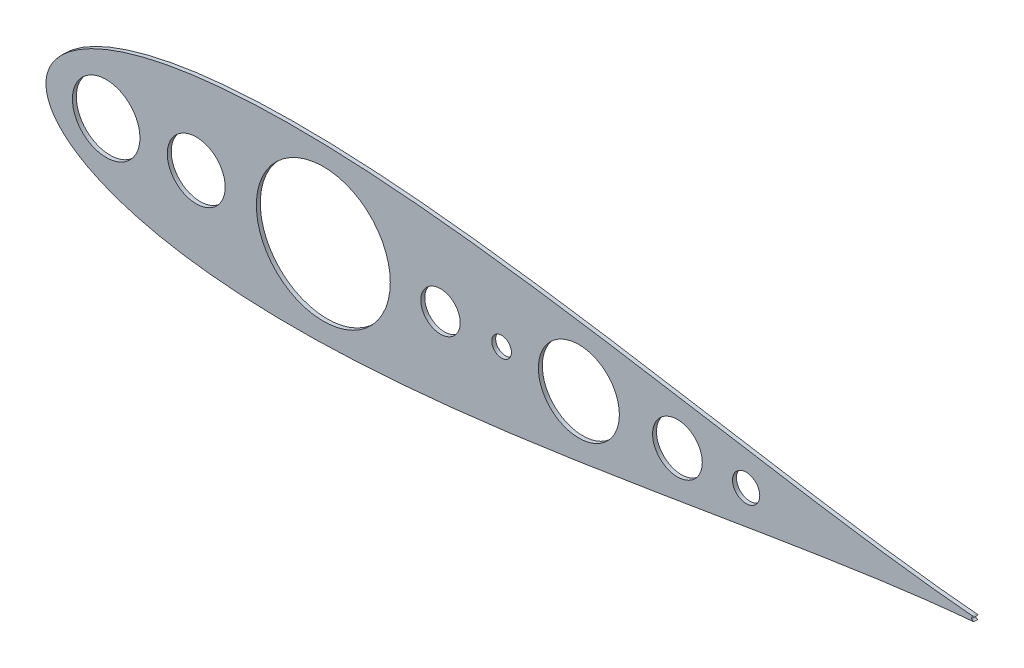
ISO-10303-21;
HEADER;
FILE_DESCRIPTION(('STEP AP214'),'2;1');
FILE_NAME('part.step','',(''),(''),'','','');
FILE_SCHEMA(('AUTOMOTIVE_DESIGN { 1 0 10303 214 1 1 1 1 }'));
ENDSEC;
DATA;
#1=APPLICATION_CONTEXT('core data for automotive mechanical design processes');
#2=APPLICATION_PROTOCOL_DEFINITION('international standard','automotive_design',2000,#1);
#3=PRODUCT_CONTEXT('',#1,'mechanical');
#4=PRODUCT('Part','Part','',(#3));
#5=PRODUCT_RELATED_PRODUCT_CATEGORY('part','',(#4));
#6=PRODUCT_DEFINITION_FORMATION('','',#4);
#7=PRODUCT_DEFINITION_CONTEXT('part definition',#1,'design');
#8=PRODUCT_DEFINITION('design','',#6,#7);
#9=PRODUCT_DEFINITION_SHAPE('','',#8);
#10=(LENGTH_UNIT() NAMED_UNIT(*) SI_UNIT(.MILLI.,.METRE.));
#11=(NAMED_UNIT(*) PLANE_ANGLE_UNIT() SI_UNIT($,.RADIAN.));
#12=(NAMED_UNIT(*) SI_UNIT($,.STERADIAN.) SOLID_ANGLE_UNIT());
#13=UNCERTAINTY_MEASURE_WITH_UNIT(LENGTH_MEASURE(1.E-05),#10,'distance_accuracy_value','');
#14=(GEOMETRIC_REPRESENTATION_CONTEXT(3) GLOBAL_UNCERTAINTY_ASSIGNED_CONTEXT((#13)) GLOBAL_UNIT_ASSIGNED_CONTEXT((#10,
#11,#12)) REPRESENTATION_CONTEXT('',''));
#15=CARTESIAN_POINT('',(0.,0.,0.));
#16=DIRECTION('',(0.,0.,1.));
#17=DIRECTION('',(1.,0.,0.));
#18=AXIS2_PLACEMENT_3D('',#15,#16,#17);
#19=CARTESIAN_POINT('',(293.281074332886,511.948665512578,2.54));
#20=DIRECTION('',(0.,0.,1.));
#21=DIRECTION('',(1.,0.,0.));
#22=AXIS2_PLACEMENT_3D('',#19,#20,#21);
#23=PLANE('',#22);
#24=CARTESIAN_POINT('',(636.78788281488,511.9486655088,2.54));
#25=DIRECTION('',(0.,0.,1.));
#26=DIRECTION('',(1.,0.,0.));
#27=AXIS2_PLACEMENT_3D('',#24,#25,#26);
#28=CIRCLE('',#27,26.103165950104);
#29=CARTESIAN_POINT('',(662.891048764984,511.9486655088,2.54));
#30=VERTEX_POINT('',#29);
#31=EDGE_CURVE('E156',#30,#30,#28,.T.);
#32=ORIENTED_EDGE('',*,*,#31,.F.);
#33=EDGE_LOOP('',(#32));
#34=FACE_BOUND('',#33,.T.);
#35=CARTESIAN_POINT('',(744.61753790952,511.9486655088,2.54));
#36=DIRECTION('',(0.,0.,1.));
#37=DIRECTION('',(1.,0.,0.));
#38=AXIS2_PLACEMENT_3D('',#35,#36,#37);
#39=CIRCLE('',#38,8.77991454979843);
#40=CARTESIAN_POINT('',(753.397452459318,511.9486655088,2.54));
#41=VERTEX_POINT('',#40);
#42=EDGE_CURVE('E144',#41,#41,#39,.T.);
#43=ORIENTED_EDGE('',*,*,#42,.F.);
#44=EDGE_LOOP('',(#43));
#45=FACE_BOUND('',#44,.T.);
#46=CARTESIAN_POINT('',(586.98127433584,511.9486655088,2.54));
#47=DIRECTION('',(0.,0.,1.));
#48=DIRECTION('',(1.,0.,0.));
#49=AXIS2_PLACEMENT_3D('',#46,#47,#48);
#50=CIRCLE('',#49,6.34999999999997);
#51=CARTESIAN_POINT('',(593.33127433584,511.9486655088,2.54));
#52=VERTEX_POINT('',#51);
#53=EDGE_CURVE('E132',#52,#52,#50,.T.);
#54=ORIENTED_EDGE('',*,*,#53,.F.);
#55=EDGE_LOOP('',(#54));
#56=FACE_BOUND('',#55,.T.);
#57=CARTESIAN_POINT('',(390.13127433584,511.9486655088,2.54));
#58=DIRECTION('',(0.,0.,1.));
#59=DIRECTION('',(1.,0.,0.));
#60=AXIS2_PLACEMENT_3D('',#57,#58,#59);
#61=CIRCLE('',#60,18.6689999999999);
#62=CARTESIAN_POINT('',(408.80027433584,511.9486655088,2.54));
#63=VERTEX_POINT('',#62);
#64=EDGE_CURVE('E102',#63,#63,#61,.T.);
#65=ORIENTED_EDGE('',*,*,#64,.F.);
#66=EDGE_LOOP('',(#65));
#67=FACE_BOUND('',#66,.T.);
#68=CARTESIAN_POINT('',(890.816164168567,513.419961884589,2.54));
#69=CARTESIAN_POINT('',(890.334929222572,513.459981199005,2.54));
#70=CARTESIAN_POINT('',(886.708241771452,513.765463671506,2.54));
#71=CARTESIAN_POINT('',(879.565924572486,514.425614021273,2.54));
#72=CARTESIAN_POINT('',(868.964209832471,515.528471420177,2.54));
#73=CARTESIAN_POINT('',(857.2098136494,516.881784467169,2.54));
#74=CARTESIAN_POINT('',(844.346922272968,518.493665976181,2.54));
#75=CARTESIAN_POINT('',(830.43554664155,520.365757129327,2.54));
#76=CARTESIAN_POINT('',(815.53584611597,522.493860763745,2.54));
#77=CARTESIAN_POINT('',(799.712341782464,524.866984311248,2.54));
#78=CARTESIAN_POINT('',(783.032227934467,527.468245812839,2.54));
#79=CARTESIAN_POINT('',(765.565384489673,530.274419359116,2.54));
#80=CARTESIAN_POINT('',(747.383994901154,533.25652103142,2.54));
#81=CARTESIAN_POINT('',(728.562336326036,536.380171048516,2.54));
#82=CARTESIAN_POINT('',(709.176538958193,539.605942424294,2.54));
#83=CARTESIAN_POINT('',(689.30445845677,542.890066944774,2.54));
#84=CARTESIAN_POINT('',(669.025547896793,546.184960619501,2.54));
#85=CARTESIAN_POINT('',(648.42079078857,549.440003689073,2.54));
#86=CARTESIAN_POINT('',(627.572657185412,552.602222867619,2.54));
#87=CARTESIAN_POINT('',(606.565100392426,555.617231647367,2.54));
#88=CARTESIAN_POINT('',(585.483547135847,558.429920335062,2.54));
#89=CARTESIAN_POINT('',(564.414918297596,560.985438327197,2.54));
#90=CARTESIAN_POINT('',(543.447643351904,563.229982453391,2.54));
#91=CARTESIAN_POINT('',(522.671673877383,565.111747073367,2.54));
#92=CARTESIAN_POINT('',(502.178474967283,566.581679788875,2.54));
#93=CARTESIAN_POINT('',(482.061023450331,567.594398693799,2.54));
#94=CARTESIAN_POINT('',(462.413787665805,568.10904622475,2.54));
#95=CARTESIAN_POINT('',(443.332695327594,568.089939544025,2.54));
#96=CARTESIAN_POINT('',(424.9151657929,567.506768629212,2.54));
#97=CARTESIAN_POINT('',(407.260111585684,566.336700549149,2.54));
#98=CARTESIAN_POINT('',(390.468225820178,564.562768169564,2.54));
#99=CARTESIAN_POINT('',(374.64214166451,562.176975247802,2.54));
#100=CARTESIAN_POINT('',(359.887391690253,559.178484875364,2.54));
#101=CARTESIAN_POINT('',(346.313124376857,555.577330563573,2.54));
#102=CARTESIAN_POINT('',(334.034096859812,551.394617800472,2.54));
#103=CARTESIAN_POINT('',(323.172804405046,546.667615259219,2.54));
#104=CARTESIAN_POINT('',(313.861144191933,541.458918977684,2.54));
#105=CARTESIAN_POINT('',(306.238228210125,535.874228771115,2.54));
#106=CARTESIAN_POINT('',(300.432417667747,530.095948610258,2.54));
#107=CARTESIAN_POINT('',(296.501791131961,524.429595123793,2.54));
#108=CARTESIAN_POINT('',(294.309964234523,519.31741768687,2.54));
#109=CARTESIAN_POINT('',(293.424863103749,515.216496364596,2.54));
#110=CARTESIAN_POINT('',(293.223273347112,511.948665512578,2.54));
#111=CARTESIAN_POINT('',(293.424863103749,508.68083466056,2.54));
#112=CARTESIAN_POINT('',(294.309964234523,504.579913338286,2.54));
#113=CARTESIAN_POINT('',(296.501791131961,499.467735901363,2.54));
#114=CARTESIAN_POINT('',(300.432417667747,493.801382414899,2.54));
#115=CARTESIAN_POINT('',(306.238228210125,488.023102254041,2.54));
#116=CARTESIAN_POINT('',(313.861144191933,482.438412047471,2.54));
#117=CARTESIAN_POINT('',(323.172804405046,477.229715765937,2.54));
#118=CARTESIAN_POINT('',(334.034096859812,472.502713224683,2.54));
#119=CARTESIAN_POINT('',(346.313124376857,468.320000461583,2.54));
#120=CARTESIAN_POINT('',(359.887391690253,464.718846149792,2.54));
#121=CARTESIAN_POINT('',(374.64214166451,461.720355777354,2.54));
#122=CARTESIAN_POINT('',(390.468225820178,459.334562855592,2.54));
#123=CARTESIAN_POINT('',(407.260111585684,457.560630476007,2.54));
#124=CARTESIAN_POINT('',(424.9151657929,456.390562395944,2.54));
#125=CARTESIAN_POINT('',(443.332695327594,455.80739148113,2.54));
#126=CARTESIAN_POINT('',(462.413787665805,455.788284800406,2.54));
#127=CARTESIAN_POINT('',(482.061023450331,456.302932331357,2.54));
#128=CARTESIAN_POINT('',(502.178474967283,457.315651236281,2.54));
#129=CARTESIAN_POINT('',(522.671673877383,458.785583951789,2.54));
#130=CARTESIAN_POINT('',(543.447643351904,460.667348571765,2.54));
#131=CARTESIAN_POINT('',(564.414918297596,462.911892697959,2.54));
#132=CARTESIAN_POINT('',(585.483547135847,465.467410690093,2.54));
#133=CARTESIAN_POINT('',(606.565100392426,468.280099377789,2.54));
#134=CARTESIAN_POINT('',(627.572657185412,471.295108157537,2.54));
#135=CARTESIAN_POINT('',(648.42079078857,474.457327336083,2.54));
#136=CARTESIAN_POINT('',(669.025547896793,477.712370405654,2.54));
#137=CARTESIAN_POINT('',(689.30445845677,481.007264080382,2.54));
#138=CARTESIAN_POINT('',(709.176538958193,484.291388600862,2.54));
#139=CARTESIAN_POINT('',(728.562336326036,487.51715997664,2.54));
#140=CARTESIAN_POINT('',(747.383994901154,490.640809993736,2.54));
#141=CARTESIAN_POINT('',(765.565384489673,493.62291166604,2.54));
#142=CARTESIAN_POINT('',(783.032227934467,496.429085212317,2.54));
#143=CARTESIAN_POINT('',(799.712341782464,499.030346713908,2.54));
#144=CARTESIAN_POINT('',(815.53584611597,501.403470261411,2.54));
#145=CARTESIAN_POINT('',(830.43554664155,503.531573895829,2.54));
#146=CARTESIAN_POINT('',(844.346922272967,505.403665048974,2.54));
#147=CARTESIAN_POINT('',(857.2098136494,507.015546557987,2.54));
#148=CARTESIAN_POINT('',(868.96420983247,508.368859604979,2.54));
#149=CARTESIAN_POINT('',(879.565924572486,509.471717003883,2.54));
#150=CARTESIAN_POINT('',(886.708241771452,510.13186735365,2.54));
#151=CARTESIAN_POINT('',(890.334929222572,510.437349826151,2.54));
#152=CARTESIAN_POINT('',(890.816164168567,510.477369135637,2.54));
#153=B_SPLINE_CURVE_WITH_KNOTS('',3,(#68,#69,#70,#71,#72,#73,#74,#75,#76,#77,#78,#79,#80,#81,
#82,#83,#84,#85,#86,#87,#88,#89,#90,#91,#92,#93,#94,#95,#96,#97,#98,#99,#100,#101,#102,#103,
#104,#105,#106,#107,#108,#109,#110,#111,#112,#113,#114,#115,#116,#117,#118,#119,#120,#121,#122,
#123,#124,#125,#126,#127,#128,#129,#130,#131,#132,#133,#134,#135,#136,#137,#138,#139,#140,#141,
#142,#143,#144,#145,#146,#147,#148,#149,#150,#151,#152),.UNSPECIFIED.,.F.,.F.,(4,1,1,1,1,1,1,1,
1,1,1,1,1,1,1,1,1,1,1,1,1,1,1,1,1,1,1,1,1,1,1,1,1,1,1,1,1,1,1,1,1,1,1,1,1,1,1,1,1,1,1,1,1,1,1,1,
1,1,1,1,1,1,1,1,1,1,1,1,1,1,1,1,1,1,1,1,1,1,1,1,1,1,4),(0.020157042076269,0.0212708876900959,
0.0285525550130683,0.0367806836725549,0.0459201019032637,0.0559317636633187,0.0667728836144854,
0.0783971303496518,0.0907548266908363,0.103793164577546,0.117456431914319,0.131686225652521,
0.146421738497113,0.161599998000845,0.177156132626574,0.193023668070302,0.209134785631037,
0.225420632511523,0.241811601924249,0.258237646860869,0.274628556698349,0.290914287398014,
0.307025228908797,0.322892517177238,0.33844834182358,0.353626206573582,0.368361231970712,
0.382590427827798,0.396252960572084,0.40929041186716,0.421647009590257,0.433269881487031,
0.444109248914041,0.454118639688981,0.463255054987312,0.471479113777303,0.478755288570903,
0.485052318112802,0.490344025694165,0.494609832614287,0.497833231437255,0.5,0.502166768562745,
0.505390167385713,0.509655974305835,0.514947681887198,0.521244711429097,0.528520886222697,
0.536744945012688,0.545881360311019,0.555890751085959,0.566730118512969,0.578352990409744,
0.59070958813284,0.603747039427916,0.617409572172202,0.631638768029288,0.646373793426418,
0.66155165817642,0.677107482822761,0.692974771091203,0.709085712601986,0.725371443301651,
0.741762353139131,0.758188398075751,0.774579367488477,0.790865214368963,0.806976331929698,
0.822843867373426,0.838400001999155,0.853578261502887,0.868313774347479,0.882543568085681,
0.896206835422454,0.909245173309164,0.921602869650348,0.933227116385514,0.944068236336681,
0.954079898096736,0.963219316327445,0.971447444986932,0.978729112309904,0.979842957923731),.UNSPECIFIED.);
#154=CARTESIAN_POINT('',(890.816164168567,513.419961884589,2.54));
#155=VERTEX_POINT('',#154);
#156=CARTESIAN_POINT('',(890.816164168567,510.477369135637,2.54));
#157=VERTEX_POINT('',#156);
#158=EDGE_CURVE('E86',#155,#157,#153,.T.);
#159=ORIENTED_EDGE('',*,*,#158,.T.);
#160=CARTESIAN_POINT('',(890.693811728639,511.948665508647,2.54));
#161=DIRECTION('',(0.,0.,1.));
#162=DIRECTION('',(1.,0.,0.));
#163=AXIS2_PLACEMENT_3D('',#160,#161,#162);
#164=CIRCLE('',#163,1.47637499870053);
#165=CARTESIAN_POINT('',(891.548394929515,510.74476738606,2.54));
#166=VERTEX_POINT('',#165);
#167=EDGE_CURVE('E81',#157,#166,#164,.T.);
#168=ORIENTED_EDGE('',*,*,#167,.T.);
#169=CARTESIAN_POINT('',(891.232241768944,511.948543253512,2.54));
#170=DIRECTION('',(0.,0.,-1.));
#171=DIRECTION('',(1.,0.,0.));
#172=AXIS2_PLACEMENT_3D('',#169,#170,#171);
#173=CIRCLE('',#172,1.24460000000017);
#174=CARTESIAN_POINT('',(891.548941560062,513.152175424197,2.54));
#175=VERTEX_POINT('',#174);
#176=EDGE_CURVE('E84',#166,#175,#173,.T.);
#177=ORIENTED_EDGE('',*,*,#176,.T.);
#178=CARTESIAN_POINT('',(890.693811728639,511.948665508647,2.54));
#179=DIRECTION('',(0.,0.,1.));
#180=DIRECTION('',(1.,0.,0.));
#181=AXIS2_PLACEMENT_3D('',#178,#179,#180);
#182=CIRCLE('',#181,1.47637500162257);
#183=EDGE_CURVE('E51',#175,#155,#182,.T.);
#184=ORIENTED_EDGE('',*,*,#183,.T.);
#185=EDGE_LOOP('',(#159,#168,#177,#184));
#186=FACE_BOUND('',#185,.T.);
#187=CARTESIAN_POINT('',(547.61127433584,511.9486655088,2.54));
#188=DIRECTION('',(0.,0.,1.));
#189=DIRECTION('',(1.,0.,0.));
#190=AXIS2_PLACEMENT_3D('',#187,#188,#189);
#191=CIRCLE('',#190,12.7);
#192=CARTESIAN_POINT('',(560.31127433584,511.9486655088,2.54));
#193=VERTEX_POINT('',#192);
#194=EDGE_CURVE('E126',#193,#193,#191,.T.);
#195=ORIENTED_EDGE('',*,*,#194,.F.);
#196=EDGE_LOOP('',(#195));
#197=FACE_BOUND('',#196,.T.);
#198=CARTESIAN_POINT('',(700.32344224592,511.9486655088,2.54));
#199=DIRECTION('',(0.,0.,1.));
#200=DIRECTION('',(1.,0.,0.));
#201=AXIS2_PLACEMENT_3D('',#198,#199,#200);
#202=CIRCLE('',#201,16.0287708249209);
#203=CARTESIAN_POINT('',(716.352213070841,511.9486655088,2.54));
#204=VERTEX_POINT('',#203);
#205=EDGE_CURVE('E138',#204,#204,#202,.T.);
#206=ORIENTED_EDGE('',*,*,#205,.F.);
#207=EDGE_LOOP('',(#206));
#208=FACE_BOUND('',#207,.T.);
#209=CARTESIAN_POINT('',(332.07307721904,511.901802055434,2.54));
#210=DIRECTION('',(0.,0.,1.));
#211=DIRECTION('',(1.,0.,0.));
#212=AXIS2_PLACEMENT_3D('',#209,#210,#211);
#213=CIRCLE('',#212,21.763413500204);
#214=CARTESIAN_POINT('',(353.836490719244,511.901802055434,2.54));
#215=VERTEX_POINT('',#214);
#216=EDGE_CURVE('E150',#215,#215,#213,.T.);
#217=ORIENTED_EDGE('',*,*,#216,.F.);
#218=EDGE_LOOP('',(#217));
#219=FACE_BOUND('',#218,.T.);
#220=CARTESIAN_POINT('',(472.05063606448,511.901802055434,2.54));
#221=DIRECTION('',(0.,0.,1.));
#222=DIRECTION('',(1.,0.,0.));
#223=AXIS2_PLACEMENT_3D('',#220,#221,#222);
#224=CIRCLE('',#223,43.1669528798075);
#225=CARTESIAN_POINT('',(515.217588944287,511.901802055434,2.54));
#226=VERTEX_POINT('',#225);
#227=EDGE_CURVE('E162',#226,#226,#224,.T.);
#228=ORIENTED_EDGE('',*,*,#227,.F.);
#229=EDGE_LOOP('',(#228));
#230=FACE_BOUND('',#229,.T.);
#231=ADVANCED_FACE('F33',(#34,#45,#56,#67,#186,#197,#208,#219,#230),#23,.T.);
#232=CARTESIAN_POINT('',(293.281074332886,511.948665512578,0.));
#233=DIRECTION('',(0.,0.,1.));
#234=DIRECTION('',(1.,0.,0.));
#235=AXIS2_PLACEMENT_3D('',#232,#233,#234);
#236=PLANE('',#235);
#237=CARTESIAN_POINT('',(890.816164168567,513.419961884589,0.));
#238=CARTESIAN_POINT('',(890.334929222572,513.459981199005,0.));
#239=CARTESIAN_POINT('',(886.708241771452,513.765463671506,0.));
#240=CARTESIAN_POINT('',(879.565924572486,514.425614021273,0.));
#241=CARTESIAN_POINT('',(868.964209832471,515.528471420177,0.));
#242=CARTESIAN_POINT('',(857.2098136494,516.881784467169,0.));
#243=CARTESIAN_POINT('',(844.346922272968,518.493665976181,0.));
#244=CARTESIAN_POINT('',(830.43554664155,520.365757129327,0.));
#245=CARTESIAN_POINT('',(815.53584611597,522.493860763745,0.));
#246=CARTESIAN_POINT('',(799.712341782464,524.866984311248,0.));
#247=CARTESIAN_POINT('',(783.032227934467,527.468245812839,0.));
#248=CARTESIAN_POINT('',(765.565384489673,530.274419359116,0.));
#249=CARTESIAN_POINT('',(747.383994901154,533.25652103142,0.));
#250=CARTESIAN_POINT('',(728.562336326036,536.380171048516,0.));
#251=CARTESIAN_POINT('',(709.176538958193,539.605942424294,0.));
#252=CARTESIAN_POINT('',(689.30445845677,542.890066944774,0.));
#253=CARTESIAN_POINT('',(669.025547896793,546.184960619501,0.));
#254=CARTESIAN_POINT('',(648.42079078857,549.440003689073,0.));
#255=CARTESIAN_POINT('',(627.572657185412,552.602222867619,0.));
#256=CARTESIAN_POINT('',(606.565100392426,555.617231647367,0.));
#257=CARTESIAN_POINT('',(585.483547135847,558.429920335062,0.));
#258=CARTESIAN_POINT('',(564.414918297596,560.985438327197,0.));
#259=CARTESIAN_POINT('',(543.447643351904,563.229982453391,0.));
#260=CARTESIAN_POINT('',(522.671673877383,565.111747073367,0.));
#261=CARTESIAN_POINT('',(502.178474967283,566.581679788875,0.));
#262=CARTESIAN_POINT('',(482.061023450331,567.594398693799,0.));
#263=CARTESIAN_POINT('',(462.413787665805,568.10904622475,0.));
#264=CARTESIAN_POINT('',(443.332695327594,568.089939544025,0.));
#265=CARTESIAN_POINT('',(424.9151657929,567.506768629212,0.));
#266=CARTESIAN_POINT('',(407.260111585684,566.336700549149,0.));
#267=CARTESIAN_POINT('',(390.468225820178,564.562768169564,0.));
#268=CARTESIAN_POINT('',(374.64214166451,562.176975247802,0.));
#269=CARTESIAN_POINT('',(359.887391690253,559.178484875364,0.));
#270=CARTESIAN_POINT('',(346.313124376857,555.577330563573,0.));
#271=CARTESIAN_POINT('',(334.034096859812,551.394617800472,0.));
#272=CARTESIAN_POINT('',(323.172804405046,546.667615259219,0.));
#273=CARTESIAN_POINT('',(313.861144191933,541.458918977684,0.));
#274=CARTESIAN_POINT('',(306.238228210125,535.874228771115,0.));
#275=CARTESIAN_POINT('',(300.432417667747,530.095948610258,0.));
#276=CARTESIAN_POINT('',(296.501791131961,524.429595123793,0.));
#277=CARTESIAN_POINT('',(294.309964234523,519.31741768687,0.));
#278=CARTESIAN_POINT('',(293.424863103749,515.216496364596,0.));
#279=CARTESIAN_POINT('',(293.223273347112,511.948665512578,0.));
#280=CARTESIAN_POINT('',(293.424863103749,508.68083466056,0.));
#281=CARTESIAN_POINT('',(294.309964234523,504.579913338286,0.));
#282=CARTESIAN_POINT('',(296.501791131961,499.467735901363,0.));
#283=CARTESIAN_POINT('',(300.432417667747,493.801382414899,0.));
#284=CARTESIAN_POINT('',(306.238228210125,488.023102254041,0.));
#285=CARTESIAN_POINT('',(313.861144191933,482.438412047471,0.));
#286=CARTESIAN_POINT('',(323.172804405046,477.229715765937,0.));
#287=CARTESIAN_POINT('',(334.034096859812,472.502713224683,0.));
#288=CARTESIAN_POINT('',(346.313124376857,468.320000461583,0.));
#289=CARTESIAN_POINT('',(359.887391690253,464.718846149792,0.));
#290=CARTESIAN_POINT('',(374.64214166451,461.720355777354,0.));
#291=CARTESIAN_POINT('',(390.468225820178,459.334562855592,0.));
#292=CARTESIAN_POINT('',(407.260111585684,457.560630476007,0.));
#293=CARTESIAN_POINT('',(424.9151657929,456.390562395944,0.));
#294=CARTESIAN_POINT('',(443.332695327594,455.80739148113,0.));
#295=CARTESIAN_POINT('',(462.413787665805,455.788284800406,0.));
#296=CARTESIAN_POINT('',(482.061023450331,456.302932331357,0.));
#297=CARTESIAN_POINT('',(502.178474967283,457.315651236281,0.));
#298=CARTESIAN_POINT('',(522.671673877383,458.785583951789,0.));
#299=CARTESIAN_POINT('',(543.447643351904,460.667348571765,0.));
#300=CARTESIAN_POINT('',(564.414918297596,462.911892697959,0.));
#301=CARTESIAN_POINT('',(585.483547135847,465.467410690093,0.));
#302=CARTESIAN_POINT('',(606.565100392426,468.280099377789,0.));
#303=CARTESIAN_POINT('',(627.572657185412,471.295108157537,0.));
#304=CARTESIAN_POINT('',(648.42079078857,474.457327336083,0.));
#305=CARTESIAN_POINT('',(669.025547896793,477.712370405654,0.));
#306=CARTESIAN_POINT('',(689.30445845677,481.007264080382,0.));
#307=CARTESIAN_POINT('',(709.176538958193,484.291388600862,0.));
#308=CARTESIAN_POINT('',(728.562336326036,487.51715997664,0.));
#309=CARTESIAN_POINT('',(747.383994901154,490.640809993736,0.));
#310=CARTESIAN_POINT('',(765.565384489673,493.62291166604,0.));
#311=CARTESIAN_POINT('',(783.032227934467,496.429085212317,0.));
#312=CARTESIAN_POINT('',(799.712341782464,499.030346713908,0.));
#313=CARTESIAN_POINT('',(815.53584611597,501.403470261411,0.));
#314=CARTESIAN_POINT('',(830.43554664155,503.531573895829,0.));
#315=CARTESIAN_POINT('',(844.346922272967,505.403665048974,0.));
#316=CARTESIAN_POINT('',(857.2098136494,507.015546557987,0.));
#317=CARTESIAN_POINT('',(868.96420983247,508.368859604979,0.));
#318=CARTESIAN_POINT('',(879.565924572486,509.471717003883,0.));
#319=CARTESIAN_POINT('',(886.708241771452,510.13186735365,0.));
#320=CARTESIAN_POINT('',(890.334929222572,510.437349826151,0.));
#321=CARTESIAN_POINT('',(890.816164168567,510.477369135637,0.));
#322=B_SPLINE_CURVE_WITH_KNOTS('',3,(#237,#238,#239,#240,#241,#242,#243,#244,#245,#246,#247,
#248,#249,#250,#251,#252,#253,#254,#255,#256,#257,#258,#259,#260,#261,#262,#263,#264,#265,#266,
#267,#268,#269,#270,#271,#272,#273,#274,#275,#276,#277,#278,#279,#280,#281,#282,#283,#284,#285,
#286,#287,#288,#289,#290,#291,#292,#293,#294,#295,#296,#297,#298,#299,#300,#301,#302,#303,#304,
#305,#306,#307,#308,#309,#310,#311,#312,#313,#314,#315,#316,#317,#318,#319,#320,#321),
.UNSPECIFIED.,.F.,.F.,(4,1,1,1,1,1,1,1,1,1,1,1,1,1,1,1,1,1,1,1,1,1,1,1,1,1,1,1,1,1,1,1,1,1,1,1,
1,1,1,1,1,1,1,1,1,1,1,1,1,1,1,1,1,1,1,1,1,1,1,1,1,1,1,1,1,1,1,1,1,1,1,1,1,1,1,1,1,1,1,1,1,1,4),
(0.020157042076269,0.0212708876900959,0.0285525550130683,0.0367806836725549,0.0459201019032637,
0.0559317636633187,0.0667728836144854,0.0783971303496518,0.0907548266908363,0.103793164577546,
0.117456431914319,0.131686225652521,0.146421738497113,0.161599998000845,0.177156132626574,
0.193023668070302,0.209134785631037,0.225420632511523,0.241811601924249,0.258237646860869,
0.274628556698349,0.290914287398014,0.307025228908797,0.322892517177238,0.33844834182358,
0.353626206573582,0.368361231970712,0.382590427827798,0.396252960572084,0.40929041186716,
0.421647009590257,0.433269881487031,0.444109248914041,0.454118639688981,0.463255054987312,
0.471479113777303,0.478755288570903,0.485052318112802,0.490344025694165,0.494609832614287,
0.497833231437255,0.5,0.502166768562745,0.505390167385713,0.509655974305835,0.514947681887198,
0.521244711429097,0.528520886222697,0.536744945012688,0.545881360311019,0.555890751085959,
0.566730118512969,0.578352990409744,0.59070958813284,0.603747039427916,0.617409572172202,
0.631638768029288,0.646373793426418,0.66155165817642,0.677107482822761,0.692974771091203,
0.709085712601986,0.725371443301651,0.741762353139131,0.758188398075751,0.774579367488477,
0.790865214368963,0.806976331929698,0.822843867373426,0.838400001999155,0.853578261502887,
0.868313774347479,0.882543568085681,0.896206835422454,0.909245173309164,0.921602869650348,
0.933227116385514,0.944068236336681,0.954079898096736,0.963219316327445,0.971447444986932,
0.978729112309904,0.979842957923731),.UNSPECIFIED.);
#323=CARTESIAN_POINT('',(890.816164168567,513.419961884589,0.));
#324=VERTEX_POINT('',#323);
#325=CARTESIAN_POINT('',(890.816164168567,510.477369135637,0.));
#326=VERTEX_POINT('',#325);
#327=EDGE_CURVE('E97',#324,#326,#322,.T.);
#328=ORIENTED_EDGE('',*,*,#327,.F.);
#329=CARTESIAN_POINT('',(890.693811728639,511.948665508647,0.));
#330=DIRECTION('',(0.,0.,1.));
#331=DIRECTION('',(1.,0.,0.));
#332=AXIS2_PLACEMENT_3D('',#329,#330,#331);
#333=CIRCLE('',#332,1.47637500162257);
#334=CARTESIAN_POINT('',(891.548941560062,513.152175424197,0.));
#335=VERTEX_POINT('',#334);
#336=EDGE_CURVE('E74',#335,#324,#333,.T.);
#337=ORIENTED_EDGE('',*,*,#336,.F.);
#338=CARTESIAN_POINT('',(891.232241768944,511.948543253512,0.));
#339=DIRECTION('',(0.,0.,-1.));
#340=DIRECTION('',(1.,0.,0.));
#341=AXIS2_PLACEMENT_3D('',#338,#339,#340);
#342=CIRCLE('',#341,1.24460000000017);
#343=CARTESIAN_POINT('',(891.548394929515,510.74476738606,0.));
#344=VERTEX_POINT('',#343);
#345=EDGE_CURVE('E68',#344,#335,#342,.T.);
#346=ORIENTED_EDGE('',*,*,#345,.F.);
#347=CARTESIAN_POINT('',(890.693811728639,511.948665508647,0.));
#348=DIRECTION('',(0.,0.,1.));
#349=DIRECTION('',(1.,0.,0.));
#350=AXIS2_PLACEMENT_3D('',#347,#348,#349);
#351=CIRCLE('',#350,1.47637499870053);
#352=EDGE_CURVE('E90',#326,#344,#351,.T.);
#353=ORIENTED_EDGE('',*,*,#352,.F.);
#354=EDGE_LOOP('',(#328,#337,#346,#353));
#355=FACE_BOUND('',#354,.T.);
#356=CARTESIAN_POINT('',(390.13127433584,511.9486655088,0.));
#357=DIRECTION('',(0.,0.,1.));
#358=DIRECTION('',(1.,0.,0.));
#359=AXIS2_PLACEMENT_3D('',#356,#357,#358);
#360=CIRCLE('',#359,18.6689999999999);
#361=CARTESIAN_POINT('',(408.80027433584,511.9486655088,0.));
#362=VERTEX_POINT('',#361);
#363=EDGE_CURVE('E120',#362,#362,#360,.T.);
#364=ORIENTED_EDGE('',*,*,#363,.T.);
#365=EDGE_LOOP('',(#364));
#366=FACE_BOUND('',#365,.T.);
#367=CARTESIAN_POINT('',(547.61127433584,511.9486655088,0.));
#368=DIRECTION('',(0.,0.,1.));
#369=DIRECTION('',(1.,0.,0.));
#370=AXIS2_PLACEMENT_3D('',#367,#368,#369);
#371=CIRCLE('',#370,12.7);
#372=CARTESIAN_POINT('',(560.31127433584,511.9486655088,0.));
#373=VERTEX_POINT('',#372);
#374=EDGE_CURVE('E129',#373,#373,#371,.T.);
#375=ORIENTED_EDGE('',*,*,#374,.T.);
#376=EDGE_LOOP('',(#375));
#377=FACE_BOUND('',#376,.T.);
#378=CARTESIAN_POINT('',(586.98127433584,511.9486655088,0.));
#379=DIRECTION('',(0.,0.,1.));
#380=DIRECTION('',(1.,0.,0.));
#381=AXIS2_PLACEMENT_3D('',#378,#379,#380);
#382=CIRCLE('',#381,6.34999999999997);
#383=CARTESIAN_POINT('',(593.33127433584,511.9486655088,0.));
#384=VERTEX_POINT('',#383);
#385=EDGE_CURVE('E135',#384,#384,#382,.T.);
#386=ORIENTED_EDGE('',*,*,#385,.T.);
#387=EDGE_LOOP('',(#386));
#388=FACE_BOUND('',#387,.T.);
#389=CARTESIAN_POINT('',(700.32344224592,511.9486655088,0.));
#390=DIRECTION('',(0.,0.,1.));
#391=DIRECTION('',(1.,0.,0.));
#392=AXIS2_PLACEMENT_3D('',#389,#390,#391);
#393=CIRCLE('',#392,16.0287708249209);
#394=CARTESIAN_POINT('',(716.352213070841,511.9486655088,0.));
#395=VERTEX_POINT('',#394);
#396=EDGE_CURVE('E141',#395,#395,#393,.T.);
#397=ORIENTED_EDGE('',*,*,#396,.T.);
#398=EDGE_LOOP('',(#397));
#399=FACE_BOUND('',#398,.T.);
#400=CARTESIAN_POINT('',(744.61753790952,511.9486655088,0.));
#401=DIRECTION('',(0.,0.,1.));
#402=DIRECTION('',(1.,0.,0.));
#403=AXIS2_PLACEMENT_3D('',#400,#401,#402);
#404=CIRCLE('',#403,8.77991454979843);
#405=CARTESIAN_POINT('',(753.397452459318,511.9486655088,0.));
#406=VERTEX_POINT('',#405);
#407=EDGE_CURVE('E147',#406,#406,#404,.T.);
#408=ORIENTED_EDGE('',*,*,#407,.T.);
#409=EDGE_LOOP('',(#408));
#410=FACE_BOUND('',#409,.T.);
#411=CARTESIAN_POINT('',(332.07307721904,511.901802055434,0.));
#412=DIRECTION('',(0.,0.,1.));
#413=DIRECTION('',(1.,0.,0.));
#414=AXIS2_PLACEMENT_3D('',#411,#412,#413);
#415=CIRCLE('',#414,21.763413500204);
#416=CARTESIAN_POINT('',(353.836490719244,511.901802055434,0.));
#417=VERTEX_POINT('',#416);
#418=EDGE_CURVE('E153',#417,#417,#415,.T.);
#419=ORIENTED_EDGE('',*,*,#418,.T.);
#420=EDGE_LOOP('',(#419));
#421=FACE_BOUND('',#420,.T.);
#422=CARTESIAN_POINT('',(636.78788281488,511.9486655088,0.));
#423=DIRECTION('',(0.,0.,1.));
#424=DIRECTION('',(1.,0.,0.));
#425=AXIS2_PLACEMENT_3D('',#422,#423,#424);
#426=CIRCLE('',#425,26.103165950104);
#427=CARTESIAN_POINT('',(662.891048764984,511.9486655088,0.));
#428=VERTEX_POINT('',#427);
#429=EDGE_CURVE('E159',#428,#428,#426,.T.);
#430=ORIENTED_EDGE('',*,*,#429,.T.);
#431=EDGE_LOOP('',(#430));
#432=FACE_BOUND('',#431,.T.);
#433=CARTESIAN_POINT('',(472.05063606448,511.901802055434,0.));
#434=DIRECTION('',(0.,0.,1.));
#435=DIRECTION('',(1.,0.,0.));
#436=AXIS2_PLACEMENT_3D('',#433,#434,#435);
#437=CIRCLE('',#436,43.1669528798075);
#438=CARTESIAN_POINT('',(515.217588944287,511.901802055434,0.));
#439=VERTEX_POINT('',#438);
#440=EDGE_CURVE('E165',#439,#439,#437,.T.);
#441=ORIENTED_EDGE('',*,*,#440,.T.);
#442=EDGE_LOOP('',(#441));
#443=FACE_BOUND('',#442,.T.);
#444=ADVANCED_FACE('F113',(#355,#366,#377,#388,#399,#410,#421,#432,#443),#236,.F.);
#445=DIRECTION('',(0.,0.,-1.));
#446=VECTOR('',#445,1.);
#447=SURFACE_OF_LINEAR_EXTRUSION('',#153,#446);
#448=ORIENTED_EDGE('',*,*,#327,.T.);
#449=DIRECTION('',(0.,0.,-1.));
#450=VECTOR('',#449,1.);
#451=CARTESIAN_POINT('',(890.816164168567,510.477369135637,2.54));
#452=LINE('',#451,#450);
#453=EDGE_CURVE('E11',#157,#326,#452,.T.);
#454=ORIENTED_EDGE('',*,*,#453,.F.);
#455=ORIENTED_EDGE('',*,*,#158,.F.);
#456=DIRECTION('',(0.,0.,-1.));
#457=VECTOR('',#456,1.);
#458=CARTESIAN_POINT('',(890.816164168567,513.419961884589,2.54));
#459=LINE('',#458,#457);
#460=EDGE_CURVE('E94',#155,#324,#459,.T.);
#461=ORIENTED_EDGE('',*,*,#460,.T.);
#462=EDGE_LOOP('',(#448,#454,#455,#461));
#463=FACE_BOUND('',#462,.T.);
#464=ADVANCED_FACE('F35',(#463),#447,.F.);
#465=CARTESIAN_POINT('',(890.693811728639,511.948665508647,2.54));
#466=DIRECTION('',(0.,0.,-1.));
#467=DIRECTION('',(-1.,0.,0.));
#468=AXIS2_PLACEMENT_3D('',#465,#466,#467);
#469=CYLINDRICAL_SURFACE('',#468,1.47637499870053);
#470=ORIENTED_EDGE('',*,*,#352,.T.);
#471=DIRECTION('',(0.,0.,-1.));
#472=VECTOR('',#471,1.);
#473=CARTESIAN_POINT('',(891.548394929515,510.74476738606,2.54));
#474=LINE('',#473,#472);
#475=EDGE_CURVE('E43',#166,#344,#474,.T.);
#476=ORIENTED_EDGE('',*,*,#475,.F.);
#477=ORIENTED_EDGE('',*,*,#167,.F.);
#478=ORIENTED_EDGE('',*,*,#453,.T.);
#479=EDGE_LOOP('',(#470,#476,#477,#478));
#480=FACE_BOUND('',#479,.T.);
#481=ADVANCED_FACE('F89',(#480),#469,.T.);
#482=CARTESIAN_POINT('',(891.232241768944,511.948543253512,2.54));
#483=DIRECTION('',(0.,0.,-1.));
#484=DIRECTION('',(-1.,0.,0.));
#485=AXIS2_PLACEMENT_3D('',#482,#483,#484);
#486=CYLINDRICAL_SURFACE('',#485,1.24460000000017);
#487=ORIENTED_EDGE('',*,*,#345,.T.);
#488=DIRECTION('',(0.,0.,-1.));
#489=VECTOR('',#488,1.);
#490=CARTESIAN_POINT('',(891.548941560062,513.152175424197,2.54));
#491=LINE('',#490,#489);
#492=EDGE_CURVE('E91',#175,#335,#491,.T.);
#493=ORIENTED_EDGE('',*,*,#492,.F.);
#494=ORIENTED_EDGE('',*,*,#176,.F.);
#495=ORIENTED_EDGE('',*,*,#475,.T.);
#496=EDGE_LOOP('',(#487,#493,#494,#495));
#497=FACE_BOUND('',#496,.T.);
#498=ADVANCED_FACE('F92',(#497),#486,.F.);
#499=CARTESIAN_POINT('',(890.693811728639,511.948665508647,2.54));
#500=DIRECTION('',(0.,0.,-1.));
#501=DIRECTION('',(-1.,0.,0.));
#502=AXIS2_PLACEMENT_3D('',#499,#500,#501);
#503=CYLINDRICAL_SURFACE('',#502,1.47637500162257);
#504=ORIENTED_EDGE('',*,*,#336,.T.);
#505=ORIENTED_EDGE('',*,*,#460,.F.);
#506=ORIENTED_EDGE('',*,*,#183,.F.);
#507=ORIENTED_EDGE('',*,*,#492,.T.);
#508=EDGE_LOOP('',(#504,#505,#506,#507));
#509=FACE_BOUND('',#508,.T.);
#510=ADVANCED_FACE('F110',(#509),#503,.T.);
#511=CARTESIAN_POINT('',(390.13127433584,511.9486655088,2.54));
#512=DIRECTION('',(0.,0.,-1.));
#513=DIRECTION('',(-1.,0.,0.));
#514=AXIS2_PLACEMENT_3D('',#511,#512,#513);
#515=CYLINDRICAL_SURFACE('',#514,18.6689999999999);
#516=ORIENTED_EDGE('',*,*,#64,.T.);
#517=EDGE_LOOP('',(#516));
#518=FACE_BOUND('',#517,.T.);
#519=ORIENTED_EDGE('',*,*,#363,.F.);
#520=EDGE_LOOP('',(#519));
#521=FACE_BOUND('',#520,.T.);
#522=ADVANCED_FACE('F184',(#518,#521),#515,.F.);
#523=CARTESIAN_POINT('',(547.61127433584,511.9486655088,2.54));
#524=DIRECTION('',(0.,0.,-1.));
#525=DIRECTION('',(-1.,0.,0.));
#526=AXIS2_PLACEMENT_3D('',#523,#524,#525);
#527=CYLINDRICAL_SURFACE('',#526,12.7);
#528=ORIENTED_EDGE('',*,*,#194,.T.);
#529=EDGE_LOOP('',(#528));
#530=FACE_BOUND('',#529,.T.);
#531=ORIENTED_EDGE('',*,*,#374,.F.);
#532=EDGE_LOOP('',(#531));
#533=FACE_BOUND('',#532,.T.);
#534=ADVANCED_FACE('F230',(#530,#533),#527,.F.);
#535=CARTESIAN_POINT('',(586.98127433584,511.9486655088,2.54));
#536=DIRECTION('',(0.,0.,-1.));
#537=DIRECTION('',(-1.,0.,0.));
#538=AXIS2_PLACEMENT_3D('',#535,#536,#537);
#539=CYLINDRICAL_SURFACE('',#538,6.34999999999997);
#540=ORIENTED_EDGE('',*,*,#53,.T.);
#541=EDGE_LOOP('',(#540));
#542=FACE_BOUND('',#541,.T.);
#543=ORIENTED_EDGE('',*,*,#385,.F.);
#544=EDGE_LOOP('',(#543));
#545=FACE_BOUND('',#544,.T.);
#546=ADVANCED_FACE('F238',(#542,#545),#539,.F.);
#547=CARTESIAN_POINT('',(700.32344224592,511.9486655088,2.54));
#548=DIRECTION('',(0.,0.,-1.));
#549=DIRECTION('',(-1.,0.,0.));
#550=AXIS2_PLACEMENT_3D('',#547,#548,#549);
#551=CYLINDRICAL_SURFACE('',#550,16.0287708249209);
#552=ORIENTED_EDGE('',*,*,#205,.T.);
#553=EDGE_LOOP('',(#552));
#554=FACE_BOUND('',#553,.T.);
#555=ORIENTED_EDGE('',*,*,#396,.F.);
#556=EDGE_LOOP('',(#555));
#557=FACE_BOUND('',#556,.T.);
#558=ADVANCED_FACE('F246',(#554,#557),#551,.F.);
#559=CARTESIAN_POINT('',(744.61753790952,511.9486655088,2.54));
#560=DIRECTION('',(0.,0.,-1.));
#561=DIRECTION('',(-1.,0.,0.));
#562=AXIS2_PLACEMENT_3D('',#559,#560,#561);
#563=CYLINDRICAL_SURFACE('',#562,8.77991454979843);
#564=ORIENTED_EDGE('',*,*,#42,.T.);
#565=EDGE_LOOP('',(#564));
#566=FACE_BOUND('',#565,.T.);
#567=ORIENTED_EDGE('',*,*,#407,.F.);
#568=EDGE_LOOP('',(#567));
#569=FACE_BOUND('',#568,.T.);
#570=ADVANCED_FACE('F255',(#566,#569),#563,.F.);
#571=CARTESIAN_POINT('',(332.07307721904,511.901802055434,2.54));
#572=DIRECTION('',(0.,0.,-1.));
#573=DIRECTION('',(-1.,0.,0.));
#574=AXIS2_PLACEMENT_3D('',#571,#572,#573);
#575=CYLINDRICAL_SURFACE('',#574,21.763413500204);
#576=ORIENTED_EDGE('',*,*,#216,.T.);
#577=EDGE_LOOP('',(#576));
#578=FACE_BOUND('',#577,.T.);
#579=ORIENTED_EDGE('',*,*,#418,.F.);
#580=EDGE_LOOP('',(#579));
#581=FACE_BOUND('',#580,.T.);
#582=ADVANCED_FACE('F264',(#578,#581),#575,.F.);
#583=CARTESIAN_POINT('',(636.78788281488,511.9486655088,2.54));
#584=DIRECTION('',(0.,0.,-1.));
#585=DIRECTION('',(-1.,0.,0.));
#586=AXIS2_PLACEMENT_3D('',#583,#584,#585);
#587=CYLINDRICAL_SURFACE('',#586,26.103165950104);
#588=ORIENTED_EDGE('',*,*,#31,.T.);
#589=EDGE_LOOP('',(#588));
#590=FACE_BOUND('',#589,.T.);
#591=ORIENTED_EDGE('',*,*,#429,.F.);
#592=EDGE_LOOP('',(#591));
#593=FACE_BOUND('',#592,.T.);
#594=ADVANCED_FACE('F273',(#590,#593),#587,.F.);
#595=CARTESIAN_POINT('',(472.05063606448,511.901802055434,2.54));
#596=DIRECTION('',(0.,0.,-1.));
#597=DIRECTION('',(-1.,0.,0.));
#598=AXIS2_PLACEMENT_3D('',#595,#596,#597);
#599=CYLINDRICAL_SURFACE('',#598,43.1669528798075);
#600=ORIENTED_EDGE('',*,*,#227,.T.);
#601=EDGE_LOOP('',(#600));
#602=FACE_BOUND('',#601,.T.);
#603=ORIENTED_EDGE('',*,*,#440,.F.);
#604=EDGE_LOOP('',(#603));
#605=FACE_BOUND('',#604,.T.);
#606=ADVANCED_FACE('F171',(#602,#605),#599,.F.);
#607=CLOSED_SHELL('',(#231,#444,#464,#481,#498,#510,#522,#534,#546,#558,#570,#582,#594,#606));
#608=MANIFOLD_SOLID_BREP('B2',#607);
#609=ADVANCED_BREP_SHAPE_REPRESENTATION('',(#18,#608),#14);
#610=SHAPE_DEFINITION_REPRESENTATION(#9,#609);
ENDSEC;
END-ISO-10303-21;
